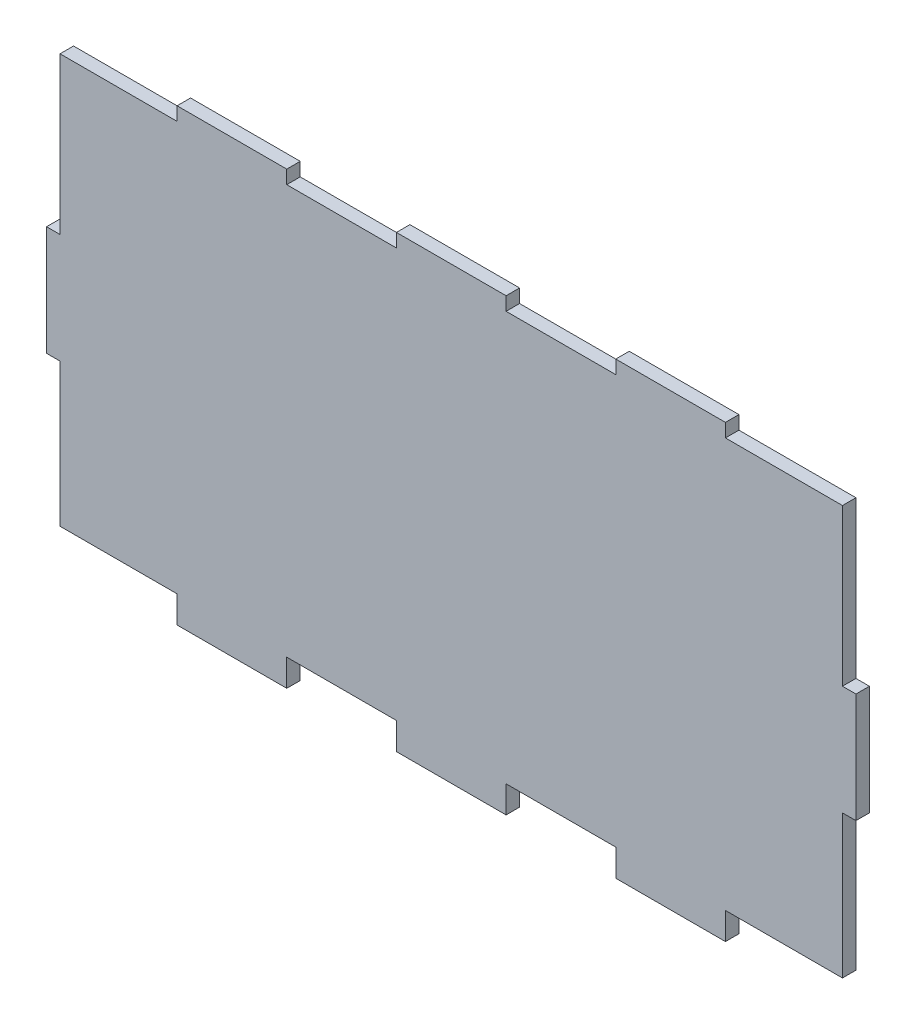
ISO-10303-21;
HEADER;
FILE_DESCRIPTION(('STEP AP214'),'2;1');
FILE_NAME('part.step','',(''),(''),'','','');
FILE_SCHEMA(('AUTOMOTIVE_DESIGN { 1 0 10303 214 1 1 1 1 }'));
ENDSEC;
DATA;
#1=APPLICATION_CONTEXT('core data for automotive mechanical design processes');
#2=APPLICATION_PROTOCOL_DEFINITION('international standard','automotive_design',2000,#1);
#3=PRODUCT_CONTEXT('',#1,'mechanical');
#4=PRODUCT('Part','Part','',(#3));
#5=PRODUCT_RELATED_PRODUCT_CATEGORY('part','',(#4));
#6=PRODUCT_DEFINITION_FORMATION('','',#4);
#7=PRODUCT_DEFINITION_CONTEXT('part definition',#1,'design');
#8=PRODUCT_DEFINITION('design','',#6,#7);
#9=PRODUCT_DEFINITION_SHAPE('','',#8);
#10=(LENGTH_UNIT() NAMED_UNIT(*) SI_UNIT(.MILLI.,.METRE.));
#11=(NAMED_UNIT(*) PLANE_ANGLE_UNIT() SI_UNIT($,.RADIAN.));
#12=(NAMED_UNIT(*) SI_UNIT($,.STERADIAN.) SOLID_ANGLE_UNIT());
#13=UNCERTAINTY_MEASURE_WITH_UNIT(LENGTH_MEASURE(1.E-05),#10,'distance_accuracy_value','');
#14=(GEOMETRIC_REPRESENTATION_CONTEXT(3) GLOBAL_UNCERTAINTY_ASSIGNED_CONTEXT((#13)) GLOBAL_UNIT_ASSIGNED_CONTEXT((#10,
#11,#12)) REPRESENTATION_CONTEXT('',''));
#15=CARTESIAN_POINT('',(0.,0.,0.));
#16=DIRECTION('',(0.,0.,1.));
#17=DIRECTION('',(1.,0.,0.));
#18=AXIS2_PLACEMENT_3D('',#15,#16,#17);
#19=CARTESIAN_POINT('',(289.,97.,3.));
#20=DIRECTION('',(1.,0.,0.));
#21=DIRECTION('',(0.,0.,-1.));
#22=AXIS2_PLACEMENT_3D('',#19,#20,#21);
#23=PLANE('',#22);
#24=DIRECTION('',(0.,-1.,0.));
#25=VECTOR('',#24,1.);
#26=CARTESIAN_POINT('',(289.,97.,0.));
#27=LINE('',#26,#25);
#28=CARTESIAN_POINT('',(289.,97.,0.));
#29=VERTEX_POINT('',#28);
#30=CARTESIAN_POINT('',(289.,62.195,0.));
#31=VERTEX_POINT('',#30);
#32=EDGE_CURVE('E293',#29,#31,#27,.T.);
#33=ORIENTED_EDGE('',*,*,#32,.T.);
#34=DIRECTION('',(0.,0.,-1.));
#35=VECTOR('',#34,1.);
#36=CARTESIAN_POINT('',(289.,62.195,3.));
#37=LINE('',#36,#35);
#38=CARTESIAN_POINT('',(289.,62.195,3.));
#39=VERTEX_POINT('',#38);
#40=EDGE_CURVE('E40',#39,#31,#37,.T.);
#41=ORIENTED_EDGE('',*,*,#40,.F.);
#42=DIRECTION('',(0.,-1.,0.));
#43=VECTOR('',#42,1.);
#44=CARTESIAN_POINT('',(289.,97.,3.));
#45=LINE('',#44,#43);
#46=CARTESIAN_POINT('',(289.,97.,3.));
#47=VERTEX_POINT('',#46);
#48=EDGE_CURVE('E330',#47,#39,#45,.T.);
#49=ORIENTED_EDGE('',*,*,#48,.F.);
#50=DIRECTION('',(0.,0.,-1.));
#51=VECTOR('',#50,1.);
#52=CARTESIAN_POINT('',(289.,97.,3.));
#53=LINE('',#52,#51);
#54=EDGE_CURVE('E11',#47,#29,#53,.T.);
#55=ORIENTED_EDGE('',*,*,#54,.T.);
#56=EDGE_LOOP('',(#33,#41,#49,#55));
#57=FACE_BOUND('',#56,.T.);
#58=ADVANCED_FACE('F33',(#57),#23,.F.);
#59=CARTESIAN_POINT('',(289.,62.195,3.));
#60=DIRECTION('',(0.,-1.,0.));
#61=DIRECTION('',(0.,0.,-1.));
#62=AXIS2_PLACEMENT_3D('',#59,#60,#61);
#63=PLANE('',#62);
#64=DIRECTION('',(-1.,0.,0.));
#65=VECTOR('',#64,1.);
#66=CARTESIAN_POINT('',(289.,62.195,0.));
#67=LINE('',#66,#65);
#68=CARTESIAN_POINT('',(286.,62.195,0.));
#69=VERTEX_POINT('',#68);
#70=EDGE_CURVE('E396',#31,#69,#67,.T.);
#71=ORIENTED_EDGE('',*,*,#70,.T.);
#72=DIRECTION('',(0.,0.,-1.));
#73=VECTOR('',#72,1.);
#74=CARTESIAN_POINT('',(286.,62.195,3.));
#75=LINE('',#74,#73);
#76=CARTESIAN_POINT('',(286.,62.195,3.));
#77=VERTEX_POINT('',#76);
#78=EDGE_CURVE('E526',#77,#69,#75,.T.);
#79=ORIENTED_EDGE('',*,*,#78,.F.);
#80=DIRECTION('',(-1.,0.,0.));
#81=VECTOR('',#80,1.);
#82=CARTESIAN_POINT('',(289.,62.195,3.));
#83=LINE('',#82,#81);
#84=EDGE_CURVE('E333',#39,#77,#83,.T.);
#85=ORIENTED_EDGE('',*,*,#84,.F.);
#86=ORIENTED_EDGE('',*,*,#40,.T.);
#87=EDGE_LOOP('',(#71,#79,#85,#86));
#88=FACE_BOUND('',#87,.T.);
#89=ADVANCED_FACE('F533',(#88),#63,.F.);
#90=CARTESIAN_POINT('',(286.,62.195,3.));
#91=DIRECTION('',(1.,0.,0.));
#92=DIRECTION('',(0.,0.,-1.));
#93=AXIS2_PLACEMENT_3D('',#90,#91,#92);
#94=PLANE('',#93);
#95=DIRECTION('',(0.,-1.,0.));
#96=VECTOR('',#95,1.);
#97=CARTESIAN_POINT('',(286.,62.195,0.));
#98=LINE('',#97,#96);
#99=CARTESIAN_POINT('',(286.,37.805,0.));
#100=VERTEX_POINT('',#99);
#101=EDGE_CURVE('E398',#69,#100,#98,.T.);
#102=ORIENTED_EDGE('',*,*,#101,.T.);
#103=DIRECTION('',(0.,0.,-1.));
#104=VECTOR('',#103,1.);
#105=CARTESIAN_POINT('',(286.,37.805,3.));
#106=LINE('',#105,#104);
#107=CARTESIAN_POINT('',(286.,37.805,3.));
#108=VERTEX_POINT('',#107);
#109=EDGE_CURVE('E523',#108,#100,#106,.T.);
#110=ORIENTED_EDGE('',*,*,#109,.F.);
#111=DIRECTION('',(0.,-1.,0.));
#112=VECTOR('',#111,1.);
#113=CARTESIAN_POINT('',(286.,62.195,3.));
#114=LINE('',#113,#112);
#115=EDGE_CURVE('E335',#77,#108,#114,.T.);
#116=ORIENTED_EDGE('',*,*,#115,.F.);
#117=ORIENTED_EDGE('',*,*,#78,.T.);
#118=EDGE_LOOP('',(#102,#110,#116,#117));
#119=FACE_BOUND('',#118,.T.);
#120=ADVANCED_FACE('F542',(#119),#94,.F.);
#121=CARTESIAN_POINT('',(286.,37.805,3.));
#122=DIRECTION('',(0.,1.,0.));
#123=DIRECTION('',(0.,0.,1.));
#124=AXIS2_PLACEMENT_3D('',#121,#122,#123);
#125=PLANE('',#124);
#126=DIRECTION('',(1.,0.,0.));
#127=VECTOR('',#126,1.);
#128=CARTESIAN_POINT('',(286.,37.805,0.));
#129=LINE('',#128,#127);
#130=CARTESIAN_POINT('',(289.,37.805,0.));
#131=VERTEX_POINT('',#130);
#132=EDGE_CURVE('E400',#100,#131,#129,.T.);
#133=ORIENTED_EDGE('',*,*,#132,.T.);
#134=DIRECTION('',(0.,0.,-1.));
#135=VECTOR('',#134,1.);
#136=CARTESIAN_POINT('',(289.,37.805,3.));
#137=LINE('',#136,#135);
#138=CARTESIAN_POINT('',(289.,37.805,3.));
#139=VERTEX_POINT('',#138);
#140=EDGE_CURVE('E520',#139,#131,#137,.T.);
#141=ORIENTED_EDGE('',*,*,#140,.F.);
#142=DIRECTION('',(1.,0.,0.));
#143=VECTOR('',#142,1.);
#144=CARTESIAN_POINT('',(286.,37.805,3.));
#145=LINE('',#144,#143);
#146=EDGE_CURVE('E337',#108,#139,#145,.T.);
#147=ORIENTED_EDGE('',*,*,#146,.F.);
#148=ORIENTED_EDGE('',*,*,#109,.T.);
#149=EDGE_LOOP('',(#133,#141,#147,#148));
#150=FACE_BOUND('',#149,.T.);
#151=ADVANCED_FACE('F546',(#150),#125,.F.);
#152=CARTESIAN_POINT('',(289.,13.415,3.));
#153=DIRECTION('',(1.,0.,0.));
#154=DIRECTION('',(0.,0.,-1.));
#155=AXIS2_PLACEMENT_3D('',#152,#153,#154);
#156=PLANE('',#155);
#157=DIRECTION('',(0.,-1.,0.));
#158=VECTOR('',#157,1.);
#159=CARTESIAN_POINT('',(289.,13.415,0.));
#160=LINE('',#159,#158);
#161=CARTESIAN_POINT('',(289.,6.,0.));
#162=VERTEX_POINT('',#161);
#163=EDGE_CURVE('E276',#131,#162,#160,.T.);
#164=ORIENTED_EDGE('',*,*,#163,.T.);
#165=DIRECTION('',(0.,0.,1.));
#166=VECTOR('',#165,1.);
#167=CARTESIAN_POINT('',(289.,6.,0.));
#168=LINE('',#167,#166);
#169=CARTESIAN_POINT('',(289.,6.,3.));
#170=VERTEX_POINT('',#169);
#171=EDGE_CURVE('E284',#162,#170,#168,.T.);
#172=ORIENTED_EDGE('',*,*,#171,.T.);
#173=DIRECTION('',(0.,-1.,0.));
#174=VECTOR('',#173,1.);
#175=CARTESIAN_POINT('',(289.,37.805,3.));
#176=LINE('',#175,#174);
#177=EDGE_CURVE('E339',#139,#170,#176,.T.);
#178=ORIENTED_EDGE('',*,*,#177,.F.);
#179=ORIENTED_EDGE('',*,*,#140,.T.);
#180=EDGE_LOOP('',(#164,#172,#178,#179));
#181=FACE_BOUND('',#180,.T.);
#182=ADVANCED_FACE('F691',(#181),#156,.F.);
#183=CARTESIAN_POINT('',(315.025,3.,3.));
#184=DIRECTION('',(1.,0.,0.));
#185=DIRECTION('',(0.,0.,-1.));
#186=AXIS2_PLACEMENT_3D('',#183,#184,#185);
#187=PLANE('',#186);
#188=DIRECTION('',(0.,-1.,0.));
#189=VECTOR('',#188,1.);
#190=CARTESIAN_POINT('',(315.025,3.,0.));
#191=LINE('',#190,#189);
#192=CARTESIAN_POINT('',(315.025,6.,0.));
#193=VERTEX_POINT('',#192);
#194=CARTESIAN_POINT('',(315.025,0.,0.));
#195=VERTEX_POINT('',#194);
#196=EDGE_CURVE('E265',#193,#195,#191,.T.);
#197=ORIENTED_EDGE('',*,*,#196,.T.);
#198=DIRECTION('',(0.,0.,-1.));
#199=VECTOR('',#198,1.);
#200=CARTESIAN_POINT('',(315.025,0.,3.));
#201=LINE('',#200,#199);
#202=CARTESIAN_POINT('',(315.025,0.,3.));
#203=VERTEX_POINT('',#202);
#204=EDGE_CURVE('E518',#203,#195,#201,.T.);
#205=ORIENTED_EDGE('',*,*,#204,.F.);
#206=DIRECTION('',(0.,-1.,0.));
#207=VECTOR('',#206,1.);
#208=CARTESIAN_POINT('',(315.025,3.,3.));
#209=LINE('',#208,#207);
#210=CARTESIAN_POINT('',(315.025,6.,3.));
#211=VERTEX_POINT('',#210);
#212=EDGE_CURVE('E281',#211,#203,#209,.T.);
#213=ORIENTED_EDGE('',*,*,#212,.F.);
#214=DIRECTION('',(0.,0.,1.));
#215=VECTOR('',#214,1.);
#216=CARTESIAN_POINT('',(315.025,6.,0.));
#217=LINE('',#216,#215);
#218=EDGE_CURVE('E279',#193,#211,#217,.T.);
#219=ORIENTED_EDGE('',*,*,#218,.F.);
#220=EDGE_LOOP('',(#197,#205,#213,#219));
#221=FACE_BOUND('',#220,.T.);
#222=ADVANCED_FACE('F280',(#221),#187,.F.);
#223=CARTESIAN_POINT('',(315.025,0.,3.));
#224=DIRECTION('',(0.,1.,0.));
#225=DIRECTION('',(0.,0.,1.));
#226=AXIS2_PLACEMENT_3D('',#223,#224,#225);
#227=PLANE('',#226);
#228=DIRECTION('',(1.,0.,0.));
#229=VECTOR('',#228,1.);
#230=CARTESIAN_POINT('',(315.025,0.,0.));
#231=LINE('',#230,#229);
#232=CARTESIAN_POINT('',(339.415,0.,0.));
#233=VERTEX_POINT('',#232);
#234=EDGE_CURVE('E272',#195,#233,#231,.T.);
#235=ORIENTED_EDGE('',*,*,#234,.T.);
#236=DIRECTION('',(0.,0.,-1.));
#237=VECTOR('',#236,1.);
#238=CARTESIAN_POINT('',(339.415,0.,3.));
#239=LINE('',#238,#237);
#240=CARTESIAN_POINT('',(339.415,0.,3.));
#241=VERTEX_POINT('',#240);
#242=EDGE_CURVE('E515',#241,#233,#239,.T.);
#243=ORIENTED_EDGE('',*,*,#242,.F.);
#244=DIRECTION('',(1.,0.,0.));
#245=VECTOR('',#244,1.);
#246=CARTESIAN_POINT('',(315.025,0.,3.));
#247=LINE('',#246,#245);
#248=EDGE_CURVE('E343',#203,#241,#247,.T.);
#249=ORIENTED_EDGE('',*,*,#248,.F.);
#250=ORIENTED_EDGE('',*,*,#204,.T.);
#251=EDGE_LOOP('',(#235,#243,#249,#250));
#252=FACE_BOUND('',#251,.T.);
#253=ADVANCED_FACE('F681',(#252),#227,.F.);
#254=CARTESIAN_POINT('',(339.415,0.,3.));
#255=DIRECTION('',(-1.,0.,0.));
#256=DIRECTION('',(0.,0.,1.));
#257=AXIS2_PLACEMENT_3D('',#254,#255,#256);
#258=PLANE('',#257);
#259=DIRECTION('',(0.,1.,0.));
#260=VECTOR('',#259,1.);
#261=CARTESIAN_POINT('',(339.415,0.,0.));
#262=LINE('',#261,#260);
#263=CARTESIAN_POINT('',(339.415,6.,0.));
#264=VERTEX_POINT('',#263);
#265=EDGE_CURVE('E405',#233,#264,#262,.T.);
#266=ORIENTED_EDGE('',*,*,#265,.T.);
#267=DIRECTION('',(0.,0.,1.));
#268=VECTOR('',#267,1.);
#269=CARTESIAN_POINT('',(339.415,6.,0.));
#270=LINE('',#269,#268);
#271=CARTESIAN_POINT('',(339.415,6.,3.));
#272=VERTEX_POINT('',#271);
#273=EDGE_CURVE('E290',#264,#272,#270,.T.);
#274=ORIENTED_EDGE('',*,*,#273,.T.);
#275=DIRECTION('',(0.,1.,0.));
#276=VECTOR('',#275,1.);
#277=CARTESIAN_POINT('',(339.415,0.,3.));
#278=LINE('',#277,#276);
#279=EDGE_CURVE('E345',#241,#272,#278,.T.);
#280=ORIENTED_EDGE('',*,*,#279,.F.);
#281=ORIENTED_EDGE('',*,*,#242,.T.);
#282=EDGE_LOOP('',(#266,#274,#280,#281));
#283=FACE_BOUND('',#282,.T.);
#284=ADVANCED_FACE('F679',(#283),#258,.F.);
#285=CARTESIAN_POINT('',(363.805,3.,3.));
#286=DIRECTION('',(1.,0.,0.));
#287=DIRECTION('',(0.,0.,-1.));
#288=AXIS2_PLACEMENT_3D('',#285,#286,#287);
#289=PLANE('',#288);
#290=DIRECTION('',(0.,-1.,0.));
#291=VECTOR('',#290,1.);
#292=CARTESIAN_POINT('',(363.805,3.,0.));
#293=LINE('',#292,#291);
#294=CARTESIAN_POINT('',(363.805,6.,0.));
#295=VERTEX_POINT('',#294);
#296=CARTESIAN_POINT('',(363.805,0.,0.));
#297=VERTEX_POINT('',#296);
#298=EDGE_CURVE('E47',#295,#297,#293,.T.);
#299=ORIENTED_EDGE('',*,*,#298,.T.);
#300=DIRECTION('',(0.,0.,-1.));
#301=VECTOR('',#300,1.);
#302=CARTESIAN_POINT('',(363.805,0.,3.));
#303=LINE('',#302,#301);
#304=CARTESIAN_POINT('',(363.805,0.,3.));
#305=VERTEX_POINT('',#304);
#306=EDGE_CURVE('E512',#305,#297,#303,.T.);
#307=ORIENTED_EDGE('',*,*,#306,.F.);
#308=DIRECTION('',(0.,-1.,0.));
#309=VECTOR('',#308,1.);
#310=CARTESIAN_POINT('',(363.805,3.,3.));
#311=LINE('',#310,#309);
#312=CARTESIAN_POINT('',(363.805,6.,3.));
#313=VERTEX_POINT('',#312);
#314=EDGE_CURVE('E347',#313,#305,#311,.T.);
#315=ORIENTED_EDGE('',*,*,#314,.F.);
#316=DIRECTION('',(0.,0.,1.));
#317=VECTOR('',#316,1.);
#318=CARTESIAN_POINT('',(363.805,6.,0.));
#319=LINE('',#318,#317);
#320=EDGE_CURVE('E297',#295,#313,#319,.T.);
#321=ORIENTED_EDGE('',*,*,#320,.F.);
#322=EDGE_LOOP('',(#299,#307,#315,#321));
#323=FACE_BOUND('',#322,.T.);
#324=ADVANCED_FACE('F669',(#323),#289,.F.);
#325=CARTESIAN_POINT('',(363.805,0.,3.));
#326=DIRECTION('',(0.,1.,0.));
#327=DIRECTION('',(0.,0.,1.));
#328=AXIS2_PLACEMENT_3D('',#325,#326,#327);
#329=PLANE('',#328);
#330=DIRECTION('',(1.,0.,0.));
#331=VECTOR('',#330,1.);
#332=CARTESIAN_POINT('',(363.805,0.,0.));
#333=LINE('',#332,#331);
#334=CARTESIAN_POINT('',(388.195,0.,0.));
#335=VERTEX_POINT('',#334);
#336=EDGE_CURVE('E408',#297,#335,#333,.T.);
#337=ORIENTED_EDGE('',*,*,#336,.T.);
#338=DIRECTION('',(0.,0.,-1.));
#339=VECTOR('',#338,1.);
#340=CARTESIAN_POINT('',(388.195,0.,3.));
#341=LINE('',#340,#339);
#342=CARTESIAN_POINT('',(388.195,0.,3.));
#343=VERTEX_POINT('',#342);
#344=EDGE_CURVE('E509',#343,#335,#341,.T.);
#345=ORIENTED_EDGE('',*,*,#344,.F.);
#346=DIRECTION('',(1.,0.,0.));
#347=VECTOR('',#346,1.);
#348=CARTESIAN_POINT('',(363.805,0.,3.));
#349=LINE('',#348,#347);
#350=EDGE_CURVE('E349',#305,#343,#349,.T.);
#351=ORIENTED_EDGE('',*,*,#350,.F.);
#352=ORIENTED_EDGE('',*,*,#306,.T.);
#353=EDGE_LOOP('',(#337,#345,#351,#352));
#354=FACE_BOUND('',#353,.T.);
#355=ADVANCED_FACE('F666',(#354),#329,.F.);
#356=CARTESIAN_POINT('',(388.195,0.,3.));
#357=DIRECTION('',(-1.,0.,0.));
#358=DIRECTION('',(0.,0.,1.));
#359=AXIS2_PLACEMENT_3D('',#356,#357,#358);
#360=PLANE('',#359);
#361=DIRECTION('',(0.,1.,0.));
#362=VECTOR('',#361,1.);
#363=CARTESIAN_POINT('',(388.195,0.,0.));
#364=LINE('',#363,#362);
#365=CARTESIAN_POINT('',(388.195,6.,0.));
#366=VERTEX_POINT('',#365);
#367=EDGE_CURVE('E410',#335,#366,#364,.T.);
#368=ORIENTED_EDGE('',*,*,#367,.T.);
#369=DIRECTION('',(0.,0.,1.));
#370=VECTOR('',#369,1.);
#371=CARTESIAN_POINT('',(388.195,6.,0.));
#372=LINE('',#371,#370);
#373=CARTESIAN_POINT('',(388.195,6.,3.));
#374=VERTEX_POINT('',#373);
#375=EDGE_CURVE('E301',#366,#374,#372,.T.);
#376=ORIENTED_EDGE('',*,*,#375,.T.);
#377=DIRECTION('',(0.,1.,0.));
#378=VECTOR('',#377,1.);
#379=CARTESIAN_POINT('',(388.195,0.,3.));
#380=LINE('',#379,#378);
#381=EDGE_CURVE('E351',#343,#374,#380,.T.);
#382=ORIENTED_EDGE('',*,*,#381,.F.);
#383=ORIENTED_EDGE('',*,*,#344,.T.);
#384=EDGE_LOOP('',(#368,#376,#382,#383));
#385=FACE_BOUND('',#384,.T.);
#386=ADVANCED_FACE('F663',(#385),#360,.F.);
#387=CARTESIAN_POINT('',(412.585,3.,3.));
#388=DIRECTION('',(1.,0.,0.));
#389=DIRECTION('',(0.,0.,-1.));
#390=AXIS2_PLACEMENT_3D('',#387,#388,#389);
#391=PLANE('',#390);
#392=DIRECTION('',(0.,-1.,0.));
#393=VECTOR('',#392,1.);
#394=CARTESIAN_POINT('',(412.585,3.,0.));
#395=LINE('',#394,#393);
#396=CARTESIAN_POINT('',(412.585,6.,0.));
#397=VERTEX_POINT('',#396);
#398=CARTESIAN_POINT('',(412.585,0.,0.));
#399=VERTEX_POINT('',#398);
#400=EDGE_CURVE('E54',#397,#399,#395,.T.);
#401=ORIENTED_EDGE('',*,*,#400,.T.);
#402=DIRECTION('',(0.,0.,-1.));
#403=VECTOR('',#402,1.);
#404=CARTESIAN_POINT('',(412.585,0.,3.));
#405=LINE('',#404,#403);
#406=CARTESIAN_POINT('',(412.585,0.,3.));
#407=VERTEX_POINT('',#406);
#408=EDGE_CURVE('E506',#407,#399,#405,.T.);
#409=ORIENTED_EDGE('',*,*,#408,.F.);
#410=DIRECTION('',(0.,-1.,0.));
#411=VECTOR('',#410,1.);
#412=CARTESIAN_POINT('',(412.585,3.,3.));
#413=LINE('',#412,#411);
#414=CARTESIAN_POINT('',(412.585,6.,3.));
#415=VERTEX_POINT('',#414);
#416=EDGE_CURVE('E353',#415,#407,#413,.T.);
#417=ORIENTED_EDGE('',*,*,#416,.F.);
#418=DIRECTION('',(0.,0.,1.));
#419=VECTOR('',#418,1.);
#420=CARTESIAN_POINT('',(412.585,6.,0.));
#421=LINE('',#420,#419);
#422=EDGE_CURVE('E308',#397,#415,#421,.T.);
#423=ORIENTED_EDGE('',*,*,#422,.F.);
#424=EDGE_LOOP('',(#401,#409,#417,#423));
#425=FACE_BOUND('',#424,.T.);
#426=ADVANCED_FACE('F653',(#425),#391,.F.);
#427=CARTESIAN_POINT('',(412.585,0.,3.));
#428=DIRECTION('',(0.,1.,0.));
#429=DIRECTION('',(0.,0.,1.));
#430=AXIS2_PLACEMENT_3D('',#427,#428,#429);
#431=PLANE('',#430);
#432=DIRECTION('',(1.,0.,0.));
#433=VECTOR('',#432,1.);
#434=CARTESIAN_POINT('',(412.585,0.,0.));
#435=LINE('',#434,#433);
#436=CARTESIAN_POINT('',(436.975,0.,0.));
#437=VERTEX_POINT('',#436);
#438=EDGE_CURVE('E413',#399,#437,#435,.T.);
#439=ORIENTED_EDGE('',*,*,#438,.T.);
#440=DIRECTION('',(0.,0.,-1.));
#441=VECTOR('',#440,1.);
#442=CARTESIAN_POINT('',(436.975,0.,3.));
#443=LINE('',#442,#441);
#444=CARTESIAN_POINT('',(436.975,0.,3.));
#445=VERTEX_POINT('',#444);
#446=EDGE_CURVE('E503',#445,#437,#443,.T.);
#447=ORIENTED_EDGE('',*,*,#446,.F.);
#448=DIRECTION('',(1.,0.,0.));
#449=VECTOR('',#448,1.);
#450=CARTESIAN_POINT('',(412.585,0.,3.));
#451=LINE('',#450,#449);
#452=EDGE_CURVE('E355',#407,#445,#451,.T.);
#453=ORIENTED_EDGE('',*,*,#452,.F.);
#454=ORIENTED_EDGE('',*,*,#408,.T.);
#455=EDGE_LOOP('',(#439,#447,#453,#454));
#456=FACE_BOUND('',#455,.T.);
#457=ADVANCED_FACE('F650',(#456),#431,.F.);
#458=CARTESIAN_POINT('',(436.975,0.,3.));
#459=DIRECTION('',(-1.,0.,0.));
#460=DIRECTION('',(0.,0.,1.));
#461=AXIS2_PLACEMENT_3D('',#458,#459,#460);
#462=PLANE('',#461);
#463=DIRECTION('',(0.,1.,0.));
#464=VECTOR('',#463,1.);
#465=CARTESIAN_POINT('',(436.975,0.,0.));
#466=LINE('',#465,#464);
#467=CARTESIAN_POINT('',(436.975,6.,0.));
#468=VERTEX_POINT('',#467);
#469=EDGE_CURVE('E415',#437,#468,#466,.T.);
#470=ORIENTED_EDGE('',*,*,#469,.T.);
#471=DIRECTION('',(0.,0.,1.));
#472=VECTOR('',#471,1.);
#473=CARTESIAN_POINT('',(436.975,6.,0.));
#474=LINE('',#473,#472);
#475=CARTESIAN_POINT('',(436.975,6.,3.));
#476=VERTEX_POINT('',#475);
#477=EDGE_CURVE('E312',#468,#476,#474,.T.);
#478=ORIENTED_EDGE('',*,*,#477,.T.);
#479=DIRECTION('',(0.,1.,0.));
#480=VECTOR('',#479,1.);
#481=CARTESIAN_POINT('',(436.975,0.,3.));
#482=LINE('',#481,#480);
#483=EDGE_CURVE('E357',#445,#476,#482,.T.);
#484=ORIENTED_EDGE('',*,*,#483,.F.);
#485=ORIENTED_EDGE('',*,*,#446,.T.);
#486=EDGE_LOOP('',(#470,#478,#484,#485));
#487=FACE_BOUND('',#486,.T.);
#488=ADVANCED_FACE('F647',(#487),#462,.F.);
#489=CARTESIAN_POINT('',(463.,3.,3.));
#490=DIRECTION('',(-1.,0.,0.));
#491=DIRECTION('',(0.,0.,1.));
#492=AXIS2_PLACEMENT_3D('',#489,#490,#491);
#493=PLANE('',#492);
#494=DIRECTION('',(0.,1.,0.));
#495=VECTOR('',#494,1.);
#496=CARTESIAN_POINT('',(463.,3.,3.));
#497=LINE('',#496,#495);
#498=CARTESIAN_POINT('',(463.,6.,3.));
#499=VERTEX_POINT('',#498);
#500=CARTESIAN_POINT('',(463.,37.805,3.));
#501=VERTEX_POINT('',#500);
#502=EDGE_CURVE('E359',#499,#501,#497,.T.);
#503=ORIENTED_EDGE('',*,*,#502,.F.);
#504=DIRECTION('',(0.,0.,1.));
#505=VECTOR('',#504,1.);
#506=CARTESIAN_POINT('',(463.,6.,0.));
#507=LINE('',#506,#505);
#508=CARTESIAN_POINT('',(463.,6.,0.));
#509=VERTEX_POINT('',#508);
#510=EDGE_CURVE('E320',#509,#499,#507,.T.);
#511=ORIENTED_EDGE('',*,*,#510,.F.);
#512=DIRECTION('',(0.,1.,0.));
#513=VECTOR('',#512,1.);
#514=CARTESIAN_POINT('',(463.,3.,0.));
#515=LINE('',#514,#513);
#516=CARTESIAN_POINT('',(463.,37.805,0.));
#517=VERTEX_POINT('',#516);
#518=EDGE_CURVE('E417',#509,#517,#515,.T.);
#519=ORIENTED_EDGE('',*,*,#518,.T.);
#520=DIRECTION('',(0.,0.,-1.));
#521=VECTOR('',#520,1.);
#522=CARTESIAN_POINT('',(463.,37.805,3.));
#523=LINE('',#522,#521);
#524=EDGE_CURVE('E500',#501,#517,#523,.T.);
#525=ORIENTED_EDGE('',*,*,#524,.F.);
#526=EDGE_LOOP('',(#503,#511,#519,#525));
#527=FACE_BOUND('',#526,.T.);
#528=ADVANCED_FACE('F637',(#527),#493,.F.);
#529=CARTESIAN_POINT('',(463.,37.805,3.));
#530=DIRECTION('',(0.,1.,0.));
#531=DIRECTION('',(0.,0.,1.));
#532=AXIS2_PLACEMENT_3D('',#529,#530,#531);
#533=PLANE('',#532);
#534=DIRECTION('',(1.,0.,0.));
#535=VECTOR('',#534,1.);
#536=CARTESIAN_POINT('',(463.,37.805,0.));
#537=LINE('',#536,#535);
#538=CARTESIAN_POINT('',(466.,37.805,0.));
#539=VERTEX_POINT('',#538);
#540=EDGE_CURVE('E419',#517,#539,#537,.T.);
#541=ORIENTED_EDGE('',*,*,#540,.T.);
#542=DIRECTION('',(0.,0.,-1.));
#543=VECTOR('',#542,1.);
#544=CARTESIAN_POINT('',(466.,37.805,3.));
#545=LINE('',#544,#543);
#546=CARTESIAN_POINT('',(466.,37.805,3.));
#547=VERTEX_POINT('',#546);
#548=EDGE_CURVE('E497',#547,#539,#545,.T.);
#549=ORIENTED_EDGE('',*,*,#548,.F.);
#550=DIRECTION('',(1.,0.,0.));
#551=VECTOR('',#550,1.);
#552=CARTESIAN_POINT('',(463.,37.805,3.));
#553=LINE('',#552,#551);
#554=EDGE_CURVE('E361',#501,#547,#553,.T.);
#555=ORIENTED_EDGE('',*,*,#554,.F.);
#556=ORIENTED_EDGE('',*,*,#524,.T.);
#557=EDGE_LOOP('',(#541,#549,#555,#556));
#558=FACE_BOUND('',#557,.T.);
#559=ADVANCED_FACE('F633',(#558),#533,.F.);
#560=CARTESIAN_POINT('',(466.,37.805,3.));
#561=DIRECTION('',(-1.,0.,0.));
#562=DIRECTION('',(0.,0.,1.));
#563=AXIS2_PLACEMENT_3D('',#560,#561,#562);
#564=PLANE('',#563);
#565=DIRECTION('',(0.,1.,0.));
#566=VECTOR('',#565,1.);
#567=CARTESIAN_POINT('',(466.,37.805,0.));
#568=LINE('',#567,#566);
#569=CARTESIAN_POINT('',(466.,62.195,0.));
#570=VERTEX_POINT('',#569);
#571=EDGE_CURVE('E421',#539,#570,#568,.T.);
#572=ORIENTED_EDGE('',*,*,#571,.T.);
#573=DIRECTION('',(0.,0.,-1.));
#574=VECTOR('',#573,1.);
#575=CARTESIAN_POINT('',(466.,62.195,3.));
#576=LINE('',#575,#574);
#577=CARTESIAN_POINT('',(466.,62.195,3.));
#578=VERTEX_POINT('',#577);
#579=EDGE_CURVE('E494',#578,#570,#576,.T.);
#580=ORIENTED_EDGE('',*,*,#579,.F.);
#581=DIRECTION('',(0.,1.,0.));
#582=VECTOR('',#581,1.);
#583=CARTESIAN_POINT('',(466.,37.805,3.));
#584=LINE('',#583,#582);
#585=EDGE_CURVE('E363',#547,#578,#584,.T.);
#586=ORIENTED_EDGE('',*,*,#585,.F.);
#587=ORIENTED_EDGE('',*,*,#548,.T.);
#588=EDGE_LOOP('',(#572,#580,#586,#587));
#589=FACE_BOUND('',#588,.T.);
#590=ADVANCED_FACE('F629',(#589),#564,.F.);
#591=CARTESIAN_POINT('',(466.,62.195,3.));
#592=DIRECTION('',(0.,-1.,0.));
#593=DIRECTION('',(0.,0.,-1.));
#594=AXIS2_PLACEMENT_3D('',#591,#592,#593);
#595=PLANE('',#594);
#596=DIRECTION('',(-1.,0.,0.));
#597=VECTOR('',#596,1.);
#598=CARTESIAN_POINT('',(466.,62.195,0.));
#599=LINE('',#598,#597);
#600=CARTESIAN_POINT('',(463.,62.195,0.));
#601=VERTEX_POINT('',#600);
#602=EDGE_CURVE('E423',#570,#601,#599,.T.);
#603=ORIENTED_EDGE('',*,*,#602,.T.);
#604=DIRECTION('',(0.,0.,-1.));
#605=VECTOR('',#604,1.);
#606=CARTESIAN_POINT('',(463.,62.195,3.));
#607=LINE('',#606,#605);
#608=CARTESIAN_POINT('',(463.,62.195,3.));
#609=VERTEX_POINT('',#608);
#610=EDGE_CURVE('E491',#609,#601,#607,.T.);
#611=ORIENTED_EDGE('',*,*,#610,.F.);
#612=DIRECTION('',(-1.,0.,0.));
#613=VECTOR('',#612,1.);
#614=CARTESIAN_POINT('',(466.,62.195,3.));
#615=LINE('',#614,#613);
#616=EDGE_CURVE('E365',#578,#609,#615,.T.);
#617=ORIENTED_EDGE('',*,*,#616,.F.);
#618=ORIENTED_EDGE('',*,*,#579,.T.);
#619=EDGE_LOOP('',(#603,#611,#617,#618));
#620=FACE_BOUND('',#619,.T.);
#621=ADVANCED_FACE('F620',(#620),#595,.F.);
#622=CARTESIAN_POINT('',(463.,86.585,3.));
#623=DIRECTION('',(-1.,0.,0.));
#624=DIRECTION('',(0.,0.,1.));
#625=AXIS2_PLACEMENT_3D('',#622,#623,#624);
#626=PLANE('',#625);
#627=DIRECTION('',(0.,1.,0.));
#628=VECTOR('',#627,1.);
#629=CARTESIAN_POINT('',(463.,86.585,0.));
#630=LINE('',#629,#628);
#631=CARTESIAN_POINT('',(463.,97.,0.));
#632=VERTEX_POINT('',#631);
#633=EDGE_CURVE('E426',#601,#632,#630,.T.);
#634=ORIENTED_EDGE('',*,*,#633,.T.);
#635=DIRECTION('',(0.,0.,-1.));
#636=VECTOR('',#635,1.);
#637=CARTESIAN_POINT('',(463.,97.,3.));
#638=LINE('',#637,#636);
#639=CARTESIAN_POINT('',(463.,97.,3.));
#640=VERTEX_POINT('',#639);
#641=EDGE_CURVE('E488',#640,#632,#638,.T.);
#642=ORIENTED_EDGE('',*,*,#641,.F.);
#643=DIRECTION('',(0.,1.,0.));
#644=VECTOR('',#643,1.);
#645=CARTESIAN_POINT('',(463.,62.195,3.));
#646=LINE('',#645,#644);
#647=EDGE_CURVE('E367',#609,#640,#646,.T.);
#648=ORIENTED_EDGE('',*,*,#647,.F.);
#649=ORIENTED_EDGE('',*,*,#610,.T.);
#650=EDGE_LOOP('',(#634,#642,#648,#649));
#651=FACE_BOUND('',#650,.T.);
#652=ADVANCED_FACE('F624',(#651),#626,.F.);
#653=CARTESIAN_POINT('',(463.,97.,3.));
#654=DIRECTION('',(0.,-1.,0.));
#655=DIRECTION('',(0.,0.,-1.));
#656=AXIS2_PLACEMENT_3D('',#653,#654,#655);
#657=PLANE('',#656);
#658=DIRECTION('',(-1.,0.,0.));
#659=VECTOR('',#658,1.);
#660=CARTESIAN_POINT('',(463.,97.,0.));
#661=LINE('',#660,#659);
#662=CARTESIAN_POINT('',(436.975,97.,0.));
#663=VERTEX_POINT('',#662);
#664=EDGE_CURVE('E428',#632,#663,#661,.T.);
#665=ORIENTED_EDGE('',*,*,#664,.T.);
#666=DIRECTION('',(0.,0.,-1.));
#667=VECTOR('',#666,1.);
#668=CARTESIAN_POINT('',(436.975,97.,3.));
#669=LINE('',#668,#667);
#670=CARTESIAN_POINT('',(436.975,97.,3.));
#671=VERTEX_POINT('',#670);
#672=EDGE_CURVE('E485',#671,#663,#669,.T.);
#673=ORIENTED_EDGE('',*,*,#672,.F.);
#674=DIRECTION('',(-1.,0.,0.));
#675=VECTOR('',#674,1.);
#676=CARTESIAN_POINT('',(463.,97.,3.));
#677=LINE('',#676,#675);
#678=EDGE_CURVE('E369',#640,#671,#677,.T.);
#679=ORIENTED_EDGE('',*,*,#678,.F.);
#680=ORIENTED_EDGE('',*,*,#641,.T.);
#681=EDGE_LOOP('',(#665,#673,#679,#680));
#682=FACE_BOUND('',#681,.T.);
#683=ADVANCED_FACE('F613',(#682),#657,.F.);
#684=CARTESIAN_POINT('',(436.975,97.,3.));
#685=DIRECTION('',(-1.,0.,0.));
#686=DIRECTION('',(0.,0.,1.));
#687=AXIS2_PLACEMENT_3D('',#684,#685,#686);
#688=PLANE('',#687);
#689=DIRECTION('',(0.,1.,0.));
#690=VECTOR('',#689,1.);
#691=CARTESIAN_POINT('',(436.975,97.,0.));
#692=LINE('',#691,#690);
#693=CARTESIAN_POINT('',(436.975,100.,0.));
#694=VERTEX_POINT('',#693);
#695=EDGE_CURVE('E430',#663,#694,#692,.T.);
#696=ORIENTED_EDGE('',*,*,#695,.T.);
#697=DIRECTION('',(0.,0.,-1.));
#698=VECTOR('',#697,1.);
#699=CARTESIAN_POINT('',(436.975,100.,3.));
#700=LINE('',#699,#698);
#701=CARTESIAN_POINT('',(436.975,100.,3.));
#702=VERTEX_POINT('',#701);
#703=EDGE_CURVE('E482',#702,#694,#700,.T.);
#704=ORIENTED_EDGE('',*,*,#703,.F.);
#705=DIRECTION('',(0.,1.,0.));
#706=VECTOR('',#705,1.);
#707=CARTESIAN_POINT('',(436.975,97.,3.));
#708=LINE('',#707,#706);
#709=EDGE_CURVE('E371',#671,#702,#708,.T.);
#710=ORIENTED_EDGE('',*,*,#709,.F.);
#711=ORIENTED_EDGE('',*,*,#672,.T.);
#712=EDGE_LOOP('',(#696,#704,#710,#711));
#713=FACE_BOUND('',#712,.T.);
#714=ADVANCED_FACE('F609',(#713),#688,.F.);
#715=CARTESIAN_POINT('',(436.975,100.,3.));
#716=DIRECTION('',(0.,-1.,0.));
#717=DIRECTION('',(0.,0.,-1.));
#718=AXIS2_PLACEMENT_3D('',#715,#716,#717);
#719=PLANE('',#718);
#720=DIRECTION('',(-1.,0.,0.));
#721=VECTOR('',#720,1.);
#722=CARTESIAN_POINT('',(436.975,100.,0.));
#723=LINE('',#722,#721);
#724=CARTESIAN_POINT('',(412.585,100.,0.));
#725=VERTEX_POINT('',#724);
#726=EDGE_CURVE('E432',#694,#725,#723,.T.);
#727=ORIENTED_EDGE('',*,*,#726,.T.);
#728=DIRECTION('',(0.,0.,-1.));
#729=VECTOR('',#728,1.);
#730=CARTESIAN_POINT('',(412.585,100.,3.));
#731=LINE('',#730,#729);
#732=CARTESIAN_POINT('',(412.585,100.,3.));
#733=VERTEX_POINT('',#732);
#734=EDGE_CURVE('E479',#733,#725,#731,.T.);
#735=ORIENTED_EDGE('',*,*,#734,.F.);
#736=DIRECTION('',(-1.,0.,0.));
#737=VECTOR('',#736,1.);
#738=CARTESIAN_POINT('',(436.975,100.,3.));
#739=LINE('',#738,#737);
#740=EDGE_CURVE('E373',#702,#733,#739,.T.);
#741=ORIENTED_EDGE('',*,*,#740,.F.);
#742=ORIENTED_EDGE('',*,*,#703,.T.);
#743=EDGE_LOOP('',(#727,#735,#741,#742));
#744=FACE_BOUND('',#743,.T.);
#745=ADVANCED_FACE('F604',(#744),#719,.F.);
#746=CARTESIAN_POINT('',(412.585,100.,3.));
#747=DIRECTION('',(1.,0.,0.));
#748=DIRECTION('',(0.,0.,-1.));
#749=AXIS2_PLACEMENT_3D('',#746,#747,#748);
#750=PLANE('',#749);
#751=DIRECTION('',(0.,-1.,0.));
#752=VECTOR('',#751,1.);
#753=CARTESIAN_POINT('',(412.585,100.,0.));
#754=LINE('',#753,#752);
#755=CARTESIAN_POINT('',(412.585,97.,0.));
#756=VERTEX_POINT('',#755);
#757=EDGE_CURVE('E434',#725,#756,#754,.T.);
#758=ORIENTED_EDGE('',*,*,#757,.T.);
#759=DIRECTION('',(0.,0.,-1.));
#760=VECTOR('',#759,1.);
#761=CARTESIAN_POINT('',(412.585,97.,3.));
#762=LINE('',#761,#760);
#763=CARTESIAN_POINT('',(412.585,97.,3.));
#764=VERTEX_POINT('',#763);
#765=EDGE_CURVE('E476',#764,#756,#762,.T.);
#766=ORIENTED_EDGE('',*,*,#765,.F.);
#767=DIRECTION('',(0.,-1.,0.));
#768=VECTOR('',#767,1.);
#769=CARTESIAN_POINT('',(412.585,100.,3.));
#770=LINE('',#769,#768);
#771=EDGE_CURVE('E375',#733,#764,#770,.T.);
#772=ORIENTED_EDGE('',*,*,#771,.F.);
#773=ORIENTED_EDGE('',*,*,#734,.T.);
#774=EDGE_LOOP('',(#758,#766,#772,#773));
#775=FACE_BOUND('',#774,.T.);
#776=ADVANCED_FACE('F598',(#775),#750,.F.);
#777=CARTESIAN_POINT('',(412.585,97.,3.));
#778=DIRECTION('',(0.,-1.,0.));
#779=DIRECTION('',(0.,0.,-1.));
#780=AXIS2_PLACEMENT_3D('',#777,#778,#779);
#781=PLANE('',#780);
#782=DIRECTION('',(-1.,0.,0.));
#783=VECTOR('',#782,1.);
#784=CARTESIAN_POINT('',(412.585,97.,0.));
#785=LINE('',#784,#783);
#786=CARTESIAN_POINT('',(388.195,97.,0.));
#787=VERTEX_POINT('',#786);
#788=EDGE_CURVE('E436',#756,#787,#785,.T.);
#789=ORIENTED_EDGE('',*,*,#788,.T.);
#790=DIRECTION('',(0.,0.,-1.));
#791=VECTOR('',#790,1.);
#792=CARTESIAN_POINT('',(388.195,97.,3.));
#793=LINE('',#792,#791);
#794=CARTESIAN_POINT('',(388.195,97.,3.));
#795=VERTEX_POINT('',#794);
#796=EDGE_CURVE('E473',#795,#787,#793,.T.);
#797=ORIENTED_EDGE('',*,*,#796,.F.);
#798=DIRECTION('',(-1.,0.,0.));
#799=VECTOR('',#798,1.);
#800=CARTESIAN_POINT('',(412.585,97.,3.));
#801=LINE('',#800,#799);
#802=EDGE_CURVE('E377',#764,#795,#801,.T.);
#803=ORIENTED_EDGE('',*,*,#802,.F.);
#804=ORIENTED_EDGE('',*,*,#765,.T.);
#805=EDGE_LOOP('',(#789,#797,#803,#804));
#806=FACE_BOUND('',#805,.T.);
#807=ADVANCED_FACE('F594',(#806),#781,.F.);
#808=CARTESIAN_POINT('',(388.195,97.,3.));
#809=DIRECTION('',(-1.,0.,0.));
#810=DIRECTION('',(0.,0.,1.));
#811=AXIS2_PLACEMENT_3D('',#808,#809,#810);
#812=PLANE('',#811);
#813=DIRECTION('',(0.,1.,0.));
#814=VECTOR('',#813,1.);
#815=CARTESIAN_POINT('',(388.195,97.,0.));
#816=LINE('',#815,#814);
#817=CARTESIAN_POINT('',(388.195,100.,0.));
#818=VERTEX_POINT('',#817);
#819=EDGE_CURVE('E438',#787,#818,#816,.T.);
#820=ORIENTED_EDGE('',*,*,#819,.T.);
#821=DIRECTION('',(0.,0.,-1.));
#822=VECTOR('',#821,1.);
#823=CARTESIAN_POINT('',(388.195,100.,3.));
#824=LINE('',#823,#822);
#825=CARTESIAN_POINT('',(388.195,100.,3.));
#826=VERTEX_POINT('',#825);
#827=EDGE_CURVE('E470',#826,#818,#824,.T.);
#828=ORIENTED_EDGE('',*,*,#827,.F.);
#829=DIRECTION('',(0.,1.,0.));
#830=VECTOR('',#829,1.);
#831=CARTESIAN_POINT('',(388.195,97.,3.));
#832=LINE('',#831,#830);
#833=EDGE_CURVE('E379',#795,#826,#832,.T.);
#834=ORIENTED_EDGE('',*,*,#833,.F.);
#835=ORIENTED_EDGE('',*,*,#796,.T.);
#836=EDGE_LOOP('',(#820,#828,#834,#835));
#837=FACE_BOUND('',#836,.T.);
#838=ADVANCED_FACE('F589',(#837),#812,.F.);
#839=CARTESIAN_POINT('',(388.195,100.,3.));
#840=DIRECTION('',(0.,-1.,0.));
#841=DIRECTION('',(0.,0.,-1.));
#842=AXIS2_PLACEMENT_3D('',#839,#840,#841);
#843=PLANE('',#842);
#844=DIRECTION('',(-1.,0.,0.));
#845=VECTOR('',#844,1.);
#846=CARTESIAN_POINT('',(388.195,100.,0.));
#847=LINE('',#846,#845);
#848=CARTESIAN_POINT('',(363.805,100.,0.));
#849=VERTEX_POINT('',#848);
#850=EDGE_CURVE('E440',#818,#849,#847,.T.);
#851=ORIENTED_EDGE('',*,*,#850,.T.);
#852=DIRECTION('',(0.,0.,-1.));
#853=VECTOR('',#852,1.);
#854=CARTESIAN_POINT('',(363.805,100.,3.));
#855=LINE('',#854,#853);
#856=CARTESIAN_POINT('',(363.805,100.,3.));
#857=VERTEX_POINT('',#856);
#858=EDGE_CURVE('E467',#857,#849,#855,.T.);
#859=ORIENTED_EDGE('',*,*,#858,.F.);
#860=DIRECTION('',(-1.,0.,0.));
#861=VECTOR('',#860,1.);
#862=CARTESIAN_POINT('',(388.195,100.,3.));
#863=LINE('',#862,#861);
#864=EDGE_CURVE('E381',#826,#857,#863,.T.);
#865=ORIENTED_EDGE('',*,*,#864,.F.);
#866=ORIENTED_EDGE('',*,*,#827,.T.);
#867=EDGE_LOOP('',(#851,#859,#865,#866));
#868=FACE_BOUND('',#867,.T.);
#869=ADVANCED_FACE('F583',(#868),#843,.F.);
#870=CARTESIAN_POINT('',(363.805,100.,3.));
#871=DIRECTION('',(1.,0.,0.));
#872=DIRECTION('',(0.,0.,-1.));
#873=AXIS2_PLACEMENT_3D('',#870,#871,#872);
#874=PLANE('',#873);
#875=DIRECTION('',(0.,-1.,0.));
#876=VECTOR('',#875,1.);
#877=CARTESIAN_POINT('',(363.805,100.,0.));
#878=LINE('',#877,#876);
#879=CARTESIAN_POINT('',(363.805,97.,0.));
#880=VERTEX_POINT('',#879);
#881=EDGE_CURVE('E442',#849,#880,#878,.T.);
#882=ORIENTED_EDGE('',*,*,#881,.T.);
#883=DIRECTION('',(0.,0.,-1.));
#884=VECTOR('',#883,1.);
#885=CARTESIAN_POINT('',(363.805,97.,3.));
#886=LINE('',#885,#884);
#887=CARTESIAN_POINT('',(363.805,97.,3.));
#888=VERTEX_POINT('',#887);
#889=EDGE_CURVE('E464',#888,#880,#886,.T.);
#890=ORIENTED_EDGE('',*,*,#889,.F.);
#891=DIRECTION('',(0.,-1.,0.));
#892=VECTOR('',#891,1.);
#893=CARTESIAN_POINT('',(363.805,100.,3.));
#894=LINE('',#893,#892);
#895=EDGE_CURVE('E383',#857,#888,#894,.T.);
#896=ORIENTED_EDGE('',*,*,#895,.F.);
#897=ORIENTED_EDGE('',*,*,#858,.T.);
#898=EDGE_LOOP('',(#882,#890,#896,#897));
#899=FACE_BOUND('',#898,.T.);
#900=ADVANCED_FACE('F579',(#899),#874,.F.);
#901=CARTESIAN_POINT('',(363.805,97.,3.));
#902=DIRECTION('',(0.,-1.,0.));
#903=DIRECTION('',(0.,0.,-1.));
#904=AXIS2_PLACEMENT_3D('',#901,#902,#903);
#905=PLANE('',#904);
#906=DIRECTION('',(-1.,0.,0.));
#907=VECTOR('',#906,1.);
#908=CARTESIAN_POINT('',(363.805,97.,0.));
#909=LINE('',#908,#907);
#910=CARTESIAN_POINT('',(339.415,97.,0.));
#911=VERTEX_POINT('',#910);
#912=EDGE_CURVE('E444',#880,#911,#909,.T.);
#913=ORIENTED_EDGE('',*,*,#912,.T.);
#914=DIRECTION('',(0.,0.,-1.));
#915=VECTOR('',#914,1.);
#916=CARTESIAN_POINT('',(339.415,97.,3.));
#917=LINE('',#916,#915);
#918=CARTESIAN_POINT('',(339.415,97.,3.));
#919=VERTEX_POINT('',#918);
#920=EDGE_CURVE('E461',#919,#911,#917,.T.);
#921=ORIENTED_EDGE('',*,*,#920,.F.);
#922=DIRECTION('',(-1.,0.,0.));
#923=VECTOR('',#922,1.);
#924=CARTESIAN_POINT('',(363.805,97.,3.));
#925=LINE('',#924,#923);
#926=EDGE_CURVE('E385',#888,#919,#925,.T.);
#927=ORIENTED_EDGE('',*,*,#926,.F.);
#928=ORIENTED_EDGE('',*,*,#889,.T.);
#929=EDGE_LOOP('',(#913,#921,#927,#928));
#930=FACE_BOUND('',#929,.T.);
#931=ADVANCED_FACE('F574',(#930),#905,.F.);
#932=CARTESIAN_POINT('',(339.415,97.,3.));
#933=DIRECTION('',(-1.,0.,0.));
#934=DIRECTION('',(0.,0.,1.));
#935=AXIS2_PLACEMENT_3D('',#932,#933,#934);
#936=PLANE('',#935);
#937=DIRECTION('',(0.,1.,0.));
#938=VECTOR('',#937,1.);
#939=CARTESIAN_POINT('',(339.415,97.,0.));
#940=LINE('',#939,#938);
#941=CARTESIAN_POINT('',(339.415,100.,0.));
#942=VERTEX_POINT('',#941);
#943=EDGE_CURVE('E446',#911,#942,#940,.T.);
#944=ORIENTED_EDGE('',*,*,#943,.T.);
#945=DIRECTION('',(0.,0.,-1.));
#946=VECTOR('',#945,1.);
#947=CARTESIAN_POINT('',(339.415,100.,3.));
#948=LINE('',#947,#946);
#949=CARTESIAN_POINT('',(339.415,100.,3.));
#950=VERTEX_POINT('',#949);
#951=EDGE_CURVE('E458',#950,#942,#948,.T.);
#952=ORIENTED_EDGE('',*,*,#951,.F.);
#953=DIRECTION('',(0.,1.,0.));
#954=VECTOR('',#953,1.);
#955=CARTESIAN_POINT('',(339.415,97.,3.));
#956=LINE('',#955,#954);
#957=EDGE_CURVE('E387',#919,#950,#956,.T.);
#958=ORIENTED_EDGE('',*,*,#957,.F.);
#959=ORIENTED_EDGE('',*,*,#920,.T.);
#960=EDGE_LOOP('',(#944,#952,#958,#959));
#961=FACE_BOUND('',#960,.T.);
#962=ADVANCED_FACE('F568',(#961),#936,.F.);
#963=CARTESIAN_POINT('',(339.415,100.,3.));
#964=DIRECTION('',(0.,-1.,0.));
#965=DIRECTION('',(0.,0.,-1.));
#966=AXIS2_PLACEMENT_3D('',#963,#964,#965);
#967=PLANE('',#966);
#968=DIRECTION('',(-1.,0.,0.));
#969=VECTOR('',#968,1.);
#970=CARTESIAN_POINT('',(339.415,100.,0.));
#971=LINE('',#970,#969);
#972=CARTESIAN_POINT('',(315.025,100.,0.));
#973=VERTEX_POINT('',#972);
#974=EDGE_CURVE('E448',#942,#973,#971,.T.);
#975=ORIENTED_EDGE('',*,*,#974,.T.);
#976=DIRECTION('',(0.,0.,-1.));
#977=VECTOR('',#976,1.);
#978=CARTESIAN_POINT('',(315.025,100.,3.));
#979=LINE('',#978,#977);
#980=CARTESIAN_POINT('',(315.025,100.,3.));
#981=VERTEX_POINT('',#980);
#982=EDGE_CURVE('E455',#981,#973,#979,.T.);
#983=ORIENTED_EDGE('',*,*,#982,.F.);
#984=DIRECTION('',(-1.,0.,0.));
#985=VECTOR('',#984,1.);
#986=CARTESIAN_POINT('',(339.415,100.,3.));
#987=LINE('',#986,#985);
#988=EDGE_CURVE('E389',#950,#981,#987,.T.);
#989=ORIENTED_EDGE('',*,*,#988,.F.);
#990=ORIENTED_EDGE('',*,*,#951,.T.);
#991=EDGE_LOOP('',(#975,#983,#989,#990));
#992=FACE_BOUND('',#991,.T.);
#993=ADVANCED_FACE('F564',(#992),#967,.F.);
#994=CARTESIAN_POINT('',(315.025,100.,3.));
#995=DIRECTION('',(1.,0.,0.));
#996=DIRECTION('',(0.,0.,-1.));
#997=AXIS2_PLACEMENT_3D('',#994,#995,#996);
#998=PLANE('',#997);
#999=DIRECTION('',(0.,-1.,0.));
#1000=VECTOR('',#999,1.);
#1001=CARTESIAN_POINT('',(315.025,100.,0.));
#1002=LINE('',#1001,#1000);
#1003=CARTESIAN_POINT('',(315.025,97.,0.));
#1004=VERTEX_POINT('',#1003);
#1005=EDGE_CURVE('E450',#973,#1004,#1002,.T.);
#1006=ORIENTED_EDGE('',*,*,#1005,.T.);
#1007=DIRECTION('',(0.,0.,-1.));
#1008=VECTOR('',#1007,1.);
#1009=CARTESIAN_POINT('',(315.025,97.,3.));
#1010=LINE('',#1009,#1008);
#1011=CARTESIAN_POINT('',(315.025,97.,3.));
#1012=VERTEX_POINT('',#1011);
#1013=EDGE_CURVE('E394',#1012,#1004,#1010,.T.);
#1014=ORIENTED_EDGE('',*,*,#1013,.F.);
#1015=DIRECTION('',(0.,-1.,0.));
#1016=VECTOR('',#1015,1.);
#1017=CARTESIAN_POINT('',(315.025,100.,3.));
#1018=LINE('',#1017,#1016);
#1019=EDGE_CURVE('E391',#981,#1012,#1018,.T.);
#1020=ORIENTED_EDGE('',*,*,#1019,.F.);
#1021=ORIENTED_EDGE('',*,*,#982,.T.);
#1022=EDGE_LOOP('',(#1006,#1014,#1020,#1021));
#1023=FACE_BOUND('',#1022,.T.);
#1024=ADVANCED_FACE('F559',(#1023),#998,.F.);
#1025=CARTESIAN_POINT('',(315.025,97.,3.));
#1026=DIRECTION('',(0.,-1.,0.));
#1027=DIRECTION('',(0.,0.,-1.));
#1028=AXIS2_PLACEMENT_3D('',#1025,#1026,#1027);
#1029=PLANE('',#1028);
#1030=DIRECTION('',(-1.,0.,0.));
#1031=VECTOR('',#1030,1.);
#1032=CARTESIAN_POINT('',(315.025,97.,0.));
#1033=LINE('',#1032,#1031);
#1034=EDGE_CURVE('E331',#1004,#29,#1033,.T.);
#1035=ORIENTED_EDGE('',*,*,#1034,.T.);
#1036=ORIENTED_EDGE('',*,*,#54,.F.);
#1037=DIRECTION('',(-1.,0.,0.));
#1038=VECTOR('',#1037,1.);
#1039=CARTESIAN_POINT('',(290.635,97.,3.));
#1040=LINE('',#1039,#1038);
#1041=EDGE_CURVE('E327',#1012,#47,#1040,.T.);
#1042=ORIENTED_EDGE('',*,*,#1041,.F.);
#1043=ORIENTED_EDGE('',*,*,#1013,.T.);
#1044=EDGE_LOOP('',(#1035,#1036,#1042,#1043));
#1045=FACE_BOUND('',#1044,.T.);
#1046=ADVANCED_FACE('F553',(#1045),#1029,.F.);
#1047=CARTESIAN_POINT('',(0.,0.,3.));
#1048=DIRECTION('',(0.,0.,1.));
#1049=DIRECTION('',(1.,0.,0.));
#1050=AXIS2_PLACEMENT_3D('',#1047,#1048,#1049);
#1051=PLANE('',#1050);
#1052=DIRECTION('',(-1.,0.,0.));
#1053=VECTOR('',#1052,1.);
#1054=CARTESIAN_POINT('',(315.025,6.,3.));
#1055=LINE('',#1054,#1053);
#1056=EDGE_CURVE('E288',#211,#170,#1055,.T.);
#1057=ORIENTED_EDGE('',*,*,#1056,.F.);
#1058=ORIENTED_EDGE('',*,*,#212,.T.);
#1059=ORIENTED_EDGE('',*,*,#248,.T.);
#1060=ORIENTED_EDGE('',*,*,#279,.T.);
#1061=DIRECTION('',(-1.,0.,0.));
#1062=VECTOR('',#1061,1.);
#1063=CARTESIAN_POINT('',(339.415,6.,3.));
#1064=LINE('',#1063,#1062);
#1065=EDGE_CURVE('E298',#313,#272,#1064,.T.);
#1066=ORIENTED_EDGE('',*,*,#1065,.F.);
#1067=ORIENTED_EDGE('',*,*,#314,.T.);
#1068=ORIENTED_EDGE('',*,*,#350,.T.);
#1069=ORIENTED_EDGE('',*,*,#381,.T.);
#1070=DIRECTION('',(-1.,0.,0.));
#1071=VECTOR('',#1070,1.);
#1072=CARTESIAN_POINT('',(388.195,6.,3.));
#1073=LINE('',#1072,#1071);
#1074=EDGE_CURVE('E309',#415,#374,#1073,.T.);
#1075=ORIENTED_EDGE('',*,*,#1074,.F.);
#1076=ORIENTED_EDGE('',*,*,#416,.T.);
#1077=ORIENTED_EDGE('',*,*,#452,.T.);
#1078=ORIENTED_EDGE('',*,*,#483,.T.);
#1079=DIRECTION('',(-1.,0.,0.));
#1080=VECTOR('',#1079,1.);
#1081=CARTESIAN_POINT('',(436.975,6.,3.));
#1082=LINE('',#1081,#1080);
#1083=EDGE_CURVE('E321',#499,#476,#1082,.T.);
#1084=ORIENTED_EDGE('',*,*,#1083,.F.);
#1085=ORIENTED_EDGE('',*,*,#502,.T.);
#1086=ORIENTED_EDGE('',*,*,#554,.T.);
#1087=ORIENTED_EDGE('',*,*,#585,.T.);
#1088=ORIENTED_EDGE('',*,*,#616,.T.);
#1089=ORIENTED_EDGE('',*,*,#647,.T.);
#1090=ORIENTED_EDGE('',*,*,#678,.T.);
#1091=ORIENTED_EDGE('',*,*,#709,.T.);
#1092=ORIENTED_EDGE('',*,*,#740,.T.);
#1093=ORIENTED_EDGE('',*,*,#771,.T.);
#1094=ORIENTED_EDGE('',*,*,#802,.T.);
#1095=ORIENTED_EDGE('',*,*,#833,.T.);
#1096=ORIENTED_EDGE('',*,*,#864,.T.);
#1097=ORIENTED_EDGE('',*,*,#895,.T.);
#1098=ORIENTED_EDGE('',*,*,#926,.T.);
#1099=ORIENTED_EDGE('',*,*,#957,.T.);
#1100=ORIENTED_EDGE('',*,*,#988,.T.);
#1101=ORIENTED_EDGE('',*,*,#1019,.T.);
#1102=ORIENTED_EDGE('',*,*,#1041,.T.);
#1103=ORIENTED_EDGE('',*,*,#48,.T.);
#1104=ORIENTED_EDGE('',*,*,#84,.T.);
#1105=ORIENTED_EDGE('',*,*,#115,.T.);
#1106=ORIENTED_EDGE('',*,*,#146,.T.);
#1107=ORIENTED_EDGE('',*,*,#177,.T.);
#1108=EDGE_LOOP('',(#1057,#1058,#1059,#1060,#1066,#1067,#1068,#1069,#1075,#1076,#1077,#1078,
#1084,#1085,#1086,#1087,#1088,#1089,#1090,#1091,#1092,#1093,#1094,#1095,#1096,#1097,#1098,#1099,
#1100,#1101,#1102,#1103,#1104,#1105,#1106,#1107));
#1109=FACE_BOUND('',#1108,.T.);
#1110=ADVANCED_FACE('F550',(#1109),#1051,.T.);
#1111=CARTESIAN_POINT('',(0.,0.,0.));
#1112=DIRECTION('',(0.,0.,1.));
#1113=DIRECTION('',(1.,0.,0.));
#1114=AXIS2_PLACEMENT_3D('',#1111,#1112,#1113);
#1115=PLANE('',#1114);
#1116=ORIENTED_EDGE('',*,*,#196,.F.);
#1117=DIRECTION('',(-1.,0.,0.));
#1118=VECTOR('',#1117,1.);
#1119=CARTESIAN_POINT('',(315.025,6.,0.));
#1120=LINE('',#1119,#1118);
#1121=EDGE_CURVE('E269',#193,#162,#1120,.T.);
#1122=ORIENTED_EDGE('',*,*,#1121,.T.);
#1123=ORIENTED_EDGE('',*,*,#163,.F.);
#1124=ORIENTED_EDGE('',*,*,#132,.F.);
#1125=ORIENTED_EDGE('',*,*,#101,.F.);
#1126=ORIENTED_EDGE('',*,*,#70,.F.);
#1127=ORIENTED_EDGE('',*,*,#32,.F.);
#1128=ORIENTED_EDGE('',*,*,#1034,.F.);
#1129=ORIENTED_EDGE('',*,*,#1005,.F.);
#1130=ORIENTED_EDGE('',*,*,#974,.F.);
#1131=ORIENTED_EDGE('',*,*,#943,.F.);
#1132=ORIENTED_EDGE('',*,*,#912,.F.);
#1133=ORIENTED_EDGE('',*,*,#881,.F.);
#1134=ORIENTED_EDGE('',*,*,#850,.F.);
#1135=ORIENTED_EDGE('',*,*,#819,.F.);
#1136=ORIENTED_EDGE('',*,*,#788,.F.);
#1137=ORIENTED_EDGE('',*,*,#757,.F.);
#1138=ORIENTED_EDGE('',*,*,#726,.F.);
#1139=ORIENTED_EDGE('',*,*,#695,.F.);
#1140=ORIENTED_EDGE('',*,*,#664,.F.);
#1141=ORIENTED_EDGE('',*,*,#633,.F.);
#1142=ORIENTED_EDGE('',*,*,#602,.F.);
#1143=ORIENTED_EDGE('',*,*,#571,.F.);
#1144=ORIENTED_EDGE('',*,*,#540,.F.);
#1145=ORIENTED_EDGE('',*,*,#518,.F.);
#1146=DIRECTION('',(-1.,0.,0.));
#1147=VECTOR('',#1146,1.);
#1148=CARTESIAN_POINT('',(436.975,6.,0.));
#1149=LINE('',#1148,#1147);
#1150=EDGE_CURVE('E317',#509,#468,#1149,.T.);
#1151=ORIENTED_EDGE('',*,*,#1150,.T.);
#1152=ORIENTED_EDGE('',*,*,#469,.F.);
#1153=ORIENTED_EDGE('',*,*,#438,.F.);
#1154=ORIENTED_EDGE('',*,*,#400,.F.);
#1155=DIRECTION('',(-1.,0.,0.));
#1156=VECTOR('',#1155,1.);
#1157=CARTESIAN_POINT('',(388.195,6.,0.));
#1158=LINE('',#1157,#1156);
#1159=EDGE_CURVE('E306',#397,#366,#1158,.T.);
#1160=ORIENTED_EDGE('',*,*,#1159,.T.);
#1161=ORIENTED_EDGE('',*,*,#367,.F.);
#1162=ORIENTED_EDGE('',*,*,#336,.F.);
#1163=ORIENTED_EDGE('',*,*,#298,.F.);
#1164=DIRECTION('',(-1.,0.,0.));
#1165=VECTOR('',#1164,1.);
#1166=CARTESIAN_POINT('',(339.415,6.,0.));
#1167=LINE('',#1166,#1165);
#1168=EDGE_CURVE('E295',#295,#264,#1167,.T.);
#1169=ORIENTED_EDGE('',*,*,#1168,.T.);
#1170=ORIENTED_EDGE('',*,*,#265,.F.);
#1171=ORIENTED_EDGE('',*,*,#234,.F.);
#1172=EDGE_LOOP('',(#1116,#1122,#1123,#1124,#1125,#1126,#1127,#1128,#1129,#1130,#1131,#1132,
#1133,#1134,#1135,#1136,#1137,#1138,#1139,#1140,#1141,#1142,#1143,#1144,#1145,#1151,#1152,#1153,
#1154,#1160,#1161,#1162,#1163,#1169,#1170,#1171));
#1173=FACE_BOUND('',#1172,.T.);
#1174=ADVANCED_FACE('F267',(#1173),#1115,.F.);
#1175=CARTESIAN_POINT('',(436.975,6.,0.));
#1176=DIRECTION('',(0.,1.,0.));
#1177=DIRECTION('',(0.,0.,1.));
#1178=AXIS2_PLACEMENT_3D('',#1175,#1176,#1177);
#1179=PLANE('',#1178);
#1180=ORIENTED_EDGE('',*,*,#1083,.T.);
#1181=ORIENTED_EDGE('',*,*,#477,.F.);
#1182=ORIENTED_EDGE('',*,*,#1150,.F.);
#1183=ORIENTED_EDGE('',*,*,#510,.T.);
#1184=EDGE_LOOP('',(#1180,#1181,#1182,#1183));
#1185=FACE_BOUND('',#1184,.T.);
#1186=ADVANCED_FACE('F641',(#1185),#1179,.F.);
#1187=CARTESIAN_POINT('',(388.195,6.,0.));
#1188=DIRECTION('',(0.,1.,0.));
#1189=DIRECTION('',(0.,0.,1.));
#1190=AXIS2_PLACEMENT_3D('',#1187,#1188,#1189);
#1191=PLANE('',#1190);
#1192=ORIENTED_EDGE('',*,*,#1074,.T.);
#1193=ORIENTED_EDGE('',*,*,#375,.F.);
#1194=ORIENTED_EDGE('',*,*,#1159,.F.);
#1195=ORIENTED_EDGE('',*,*,#422,.T.);
#1196=EDGE_LOOP('',(#1192,#1193,#1194,#1195));
#1197=FACE_BOUND('',#1196,.T.);
#1198=ADVANCED_FACE('F657',(#1197),#1191,.F.);
#1199=CARTESIAN_POINT('',(339.415,6.,0.));
#1200=DIRECTION('',(0.,1.,0.));
#1201=DIRECTION('',(0.,0.,1.));
#1202=AXIS2_PLACEMENT_3D('',#1199,#1200,#1201);
#1203=PLANE('',#1202);
#1204=ORIENTED_EDGE('',*,*,#1065,.T.);
#1205=ORIENTED_EDGE('',*,*,#273,.F.);
#1206=ORIENTED_EDGE('',*,*,#1168,.F.);
#1207=ORIENTED_EDGE('',*,*,#320,.T.);
#1208=EDGE_LOOP('',(#1204,#1205,#1206,#1207));
#1209=FACE_BOUND('',#1208,.T.);
#1210=ADVANCED_FACE('F673',(#1209),#1203,.F.);
#1211=CARTESIAN_POINT('',(315.025,6.,0.));
#1212=DIRECTION('',(0.,1.,0.));
#1213=DIRECTION('',(-1.,0.,0.));
#1214=AXIS2_PLACEMENT_3D('',#1211,#1212,#1213);
#1215=PLANE('',#1214);
#1216=ORIENTED_EDGE('',*,*,#1056,.T.);
#1217=ORIENTED_EDGE('',*,*,#171,.F.);
#1218=ORIENTED_EDGE('',*,*,#1121,.F.);
#1219=ORIENTED_EDGE('',*,*,#218,.T.);
#1220=EDGE_LOOP('',(#1216,#1217,#1218,#1219));
#1221=FACE_BOUND('',#1220,.T.);
#1222=ADVANCED_FACE('F286',(#1221),#1215,.F.);
#1223=CLOSED_SHELL('',(#58,#89,#120,#151,#182,#222,#253,#284,#324,#355,#386,#426,#457,#488,#528,
#559,#590,#621,#652,#683,#714,#745,#776,#807,#838,#869,#900,#931,#962,#993,#1024,#1046,#1110,
#1174,#1186,#1198,#1210,#1222));
#1224=MANIFOLD_SOLID_BREP('B2',#1223);
#1225=ADVANCED_BREP_SHAPE_REPRESENTATION('',(#18,#1224),#14);
#1226=SHAPE_DEFINITION_REPRESENTATION(#9,#1225);
ENDSEC;
END-ISO-10303-21;
